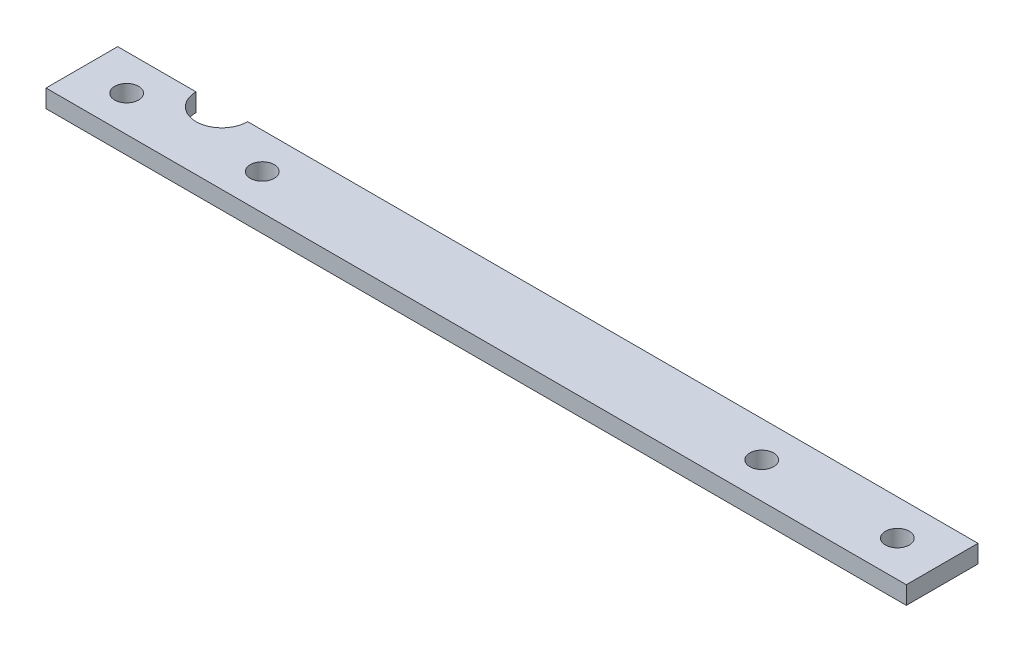
ISO-10303-21;
HEADER;
FILE_DESCRIPTION(('STEP AP214'),'2;1');
FILE_NAME('part.step','',(''),(''),'','','');
FILE_SCHEMA(('AUTOMOTIVE_DESIGN { 1 0 10303 214 1 1 1 1 }'));
ENDSEC;
DATA;
#1=APPLICATION_CONTEXT('core data for automotive mechanical design processes');
#2=APPLICATION_PROTOCOL_DEFINITION('international standard','automotive_design',2000,#1);
#3=PRODUCT_CONTEXT('',#1,'mechanical');
#4=PRODUCT('Part','Part','',(#3));
#5=PRODUCT_RELATED_PRODUCT_CATEGORY('part','',(#4));
#6=PRODUCT_DEFINITION_FORMATION('','',#4);
#7=PRODUCT_DEFINITION_CONTEXT('part definition',#1,'design');
#8=PRODUCT_DEFINITION('design','',#6,#7);
#9=PRODUCT_DEFINITION_SHAPE('','',#8);
#10=(LENGTH_UNIT() NAMED_UNIT(*) SI_UNIT(.MILLI.,.METRE.));
#11=(NAMED_UNIT(*) PLANE_ANGLE_UNIT() SI_UNIT($,.RADIAN.));
#12=(NAMED_UNIT(*) SI_UNIT($,.STERADIAN.) SOLID_ANGLE_UNIT());
#13=UNCERTAINTY_MEASURE_WITH_UNIT(LENGTH_MEASURE(1.E-05),#10,'distance_accuracy_value','');
#14=(GEOMETRIC_REPRESENTATION_CONTEXT(3) GLOBAL_UNCERTAINTY_ASSIGNED_CONTEXT((#13)) GLOBAL_UNIT_ASSIGNED_CONTEXT((#10,
#11,#12)) REPRESENTATION_CONTEXT('',''));
#15=CARTESIAN_POINT('',(0.,0.,0.));
#16=DIRECTION('',(0.,0.,1.));
#17=DIRECTION('',(1.,0.,0.));
#18=AXIS2_PLACEMENT_3D('',#15,#16,#17);
#19=CARTESIAN_POINT('',(-114.3,4.7625,-9.525));
#20=DIRECTION('',(0.,0.,-1.));
#21=DIRECTION('',(-1.,0.,0.));
#22=AXIS2_PLACEMENT_3D('',#19,#20,#21);
#23=PLANE('',#22);
#24=DIRECTION('',(0.,1.,0.));
#25=VECTOR('',#24,1.);
#26=CARTESIAN_POINT('',(-93.472,0.,-9.525));
#27=LINE('',#26,#25);
#28=CARTESIAN_POINT('',(-93.472,0.,-9.525));
#29=VERTEX_POINT('',#28);
#30=CARTESIAN_POINT('',(-93.472,4.7625,-9.525));
#31=VERTEX_POINT('',#30);
#32=EDGE_CURVE('E93',#29,#31,#27,.T.);
#33=ORIENTED_EDGE('',*,*,#32,.F.);
#34=DIRECTION('',(1.,0.,0.));
#35=VECTOR('',#34,1.);
#36=CARTESIAN_POINT('',(-114.3,0.,-9.525));
#37=LINE('',#36,#35);
#38=CARTESIAN_POINT('',(-114.3,0.,-9.525));
#39=VERTEX_POINT('',#38);
#40=EDGE_CURVE('E98',#39,#29,#37,.T.);
#41=ORIENTED_EDGE('',*,*,#40,.F.);
#42=DIRECTION('',(0.,-1.,0.));
#43=VECTOR('',#42,1.);
#44=CARTESIAN_POINT('',(-114.3,4.7625,-9.525));
#45=LINE('',#44,#43);
#46=CARTESIAN_POINT('',(-114.3,4.7625,-9.525));
#47=VERTEX_POINT('',#46);
#48=EDGE_CURVE('E56',#47,#39,#45,.T.);
#49=ORIENTED_EDGE('',*,*,#48,.F.);
#50=DIRECTION('',(1.,0.,0.));
#51=VECTOR('',#50,1.);
#52=CARTESIAN_POINT('',(-114.3,4.7625,-9.525));
#53=LINE('',#52,#51);
#54=EDGE_CURVE('E100',#47,#31,#53,.T.);
#55=ORIENTED_EDGE('',*,*,#54,.T.);
#56=EDGE_LOOP('',(#33,#41,#49,#55));
#57=FACE_BOUND('',#56,.T.);
#58=ADVANCED_FACE('F33',(#57),#23,.T.);
#59=CARTESIAN_POINT('',(-114.3,4.7625,-9.525));
#60=DIRECTION('',(1.,0.,0.));
#61=DIRECTION('',(0.,0.,-1.));
#62=AXIS2_PLACEMENT_3D('',#59,#60,#61);
#63=PLANE('',#62);
#64=DIRECTION('',(0.,0.,1.));
#65=VECTOR('',#64,1.);
#66=CARTESIAN_POINT('',(-114.3,0.,-9.525));
#67=LINE('',#66,#65);
#68=CARTESIAN_POINT('',(-114.3,0.,9.525));
#69=VERTEX_POINT('',#68);
#70=EDGE_CURVE('E104',#39,#69,#67,.T.);
#71=ORIENTED_EDGE('',*,*,#70,.T.);
#72=DIRECTION('',(0.,-1.,0.));
#73=VECTOR('',#72,1.);
#74=CARTESIAN_POINT('',(-114.3,4.7625,9.525));
#75=LINE('',#74,#73);
#76=CARTESIAN_POINT('',(-114.3,4.7625,9.525));
#77=VERTEX_POINT('',#76);
#78=EDGE_CURVE('E41',#77,#69,#75,.T.);
#79=ORIENTED_EDGE('',*,*,#78,.F.);
#80=DIRECTION('',(0.,0.,1.));
#81=VECTOR('',#80,1.);
#82=CARTESIAN_POINT('',(-114.3,4.7625,-9.525));
#83=LINE('',#82,#81);
#84=EDGE_CURVE('E105',#47,#77,#83,.T.);
#85=ORIENTED_EDGE('',*,*,#84,.F.);
#86=ORIENTED_EDGE('',*,*,#48,.T.);
#87=EDGE_LOOP('',(#71,#79,#85,#86));
#88=FACE_BOUND('',#87,.T.);
#89=ADVANCED_FACE('F35',(#88),#63,.F.);
#90=CARTESIAN_POINT('',(-114.3,4.7625,9.525));
#91=DIRECTION('',(0.,0.,-1.));
#92=DIRECTION('',(-1.,0.,0.));
#93=AXIS2_PLACEMENT_3D('',#90,#91,#92);
#94=PLANE('',#93);
#95=DIRECTION('',(1.,0.,0.));
#96=VECTOR('',#95,1.);
#97=CARTESIAN_POINT('',(-114.3,0.,9.525));
#98=LINE('',#97,#96);
#99=CARTESIAN_POINT('',(114.3,0.,9.525));
#100=VERTEX_POINT('',#99);
#101=EDGE_CURVE('E121',#69,#100,#98,.T.);
#102=ORIENTED_EDGE('',*,*,#101,.T.);
#103=DIRECTION('',(0.,-1.,0.));
#104=VECTOR('',#103,1.);
#105=CARTESIAN_POINT('',(114.3,4.7625,9.525));
#106=LINE('',#105,#104);
#107=CARTESIAN_POINT('',(114.3,4.7625,9.525));
#108=VERTEX_POINT('',#107);
#109=EDGE_CURVE('E117',#108,#100,#106,.T.);
#110=ORIENTED_EDGE('',*,*,#109,.F.);
#111=DIRECTION('',(1.,0.,0.));
#112=VECTOR('',#111,1.);
#113=CARTESIAN_POINT('',(-114.3,4.7625,9.525));
#114=LINE('',#113,#112);
#115=EDGE_CURVE('E83',#77,#108,#114,.T.);
#116=ORIENTED_EDGE('',*,*,#115,.F.);
#117=ORIENTED_EDGE('',*,*,#78,.T.);
#118=EDGE_LOOP('',(#102,#110,#116,#117));
#119=FACE_BOUND('',#118,.T.);
#120=ADVANCED_FACE('F120',(#119),#94,.F.);
#121=CARTESIAN_POINT('',(114.3,4.7625,-9.525));
#122=DIRECTION('',(1.,0.,0.));
#123=DIRECTION('',(0.,0.,-1.));
#124=AXIS2_PLACEMENT_3D('',#121,#122,#123);
#125=PLANE('',#124);
#126=DIRECTION('',(0.,0.,1.));
#127=VECTOR('',#126,1.);
#128=CARTESIAN_POINT('',(114.3,0.,-9.525));
#129=LINE('',#128,#127);
#130=CARTESIAN_POINT('',(114.3,0.,-9.525));
#131=VERTEX_POINT('',#130);
#132=EDGE_CURVE('E109',#131,#100,#129,.T.);
#133=ORIENTED_EDGE('',*,*,#132,.F.);
#134=DIRECTION('',(0.,-1.,0.));
#135=VECTOR('',#134,1.);
#136=CARTESIAN_POINT('',(114.3,4.7625,-9.525));
#137=LINE('',#136,#135);
#138=CARTESIAN_POINT('',(114.3,4.7625,-9.525));
#139=VERTEX_POINT('',#138);
#140=EDGE_CURVE('E114',#139,#131,#137,.T.);
#141=ORIENTED_EDGE('',*,*,#140,.F.);
#142=DIRECTION('',(0.,0.,1.));
#143=VECTOR('',#142,1.);
#144=CARTESIAN_POINT('',(114.3,4.7625,-9.525));
#145=LINE('',#144,#143);
#146=EDGE_CURVE('E131',#139,#108,#145,.T.);
#147=ORIENTED_EDGE('',*,*,#146,.T.);
#148=ORIENTED_EDGE('',*,*,#109,.T.);
#149=EDGE_LOOP('',(#133,#141,#147,#148));
#150=FACE_BOUND('',#149,.T.);
#151=ADVANCED_FACE('F202',(#150),#125,.T.);
#152=DIRECTION('',(0.,1.,0.));
#153=VECTOR('',#152,1.);
#154=CARTESIAN_POINT('',(-79.756,0.,-9.525));
#155=LINE('',#154,#153);
#156=CARTESIAN_POINT('',(-79.756,4.7625,-9.525));
#157=VERTEX_POINT('',#156);
#158=CARTESIAN_POINT('',(-79.756,0.,-9.525));
#159=VERTEX_POINT('',#158);
#160=EDGE_CURVE('E48',#157,#159,#155,.F.);
#161=ORIENTED_EDGE('',*,*,#160,.F.);
#162=EDGE_CURVE('E130',#157,#139,#53,.T.);
#163=ORIENTED_EDGE('',*,*,#162,.T.);
#164=ORIENTED_EDGE('',*,*,#140,.T.);
#165=EDGE_CURVE('E106',#159,#131,#37,.T.);
#166=ORIENTED_EDGE('',*,*,#165,.F.);
#167=EDGE_LOOP('',(#161,#163,#164,#166));
#168=FACE_BOUND('',#167,.T.);
#169=ADVANCED_FACE('F170',(#168),#23,.T.);
#170=CARTESIAN_POINT('',(0.,4.7625,0.));
#171=DIRECTION('',(0.,1.,0.));
#172=DIRECTION('',(0.,0.,1.));
#173=AXIS2_PLACEMENT_3D('',#170,#171,#172);
#174=PLANE('',#173);
#175=CARTESIAN_POINT('',(66.3575,4.7625,0.));
#176=DIRECTION('',(0.,1.,0.));
#177=DIRECTION('',(0.,0.,1.));
#178=AXIS2_PLACEMENT_3D('',#175,#176,#177);
#179=CIRCLE('',#178,3.175);
#180=CARTESIAN_POINT('',(66.3575,4.7625,3.175));
#181=VERTEX_POINT('',#180);
#182=EDGE_CURVE('E152',#181,#181,#179,.T.);
#183=ORIENTED_EDGE('',*,*,#182,.F.);
#184=EDGE_LOOP('',(#183));
#185=FACE_BOUND('',#184,.T.);
#186=CARTESIAN_POINT('',(-66.3575,4.7625,0.));
#187=DIRECTION('',(0.,1.,0.));
#188=DIRECTION('',(0.,0.,1.));
#189=AXIS2_PLACEMENT_3D('',#186,#187,#188);
#190=CIRCLE('',#189,3.175);
#191=CARTESIAN_POINT('',(-66.3575,4.7625,3.175));
#192=VERTEX_POINT('',#191);
#193=EDGE_CURVE('E146',#192,#192,#190,.T.);
#194=ORIENTED_EDGE('',*,*,#193,.F.);
#195=EDGE_LOOP('',(#194));
#196=FACE_BOUND('',#195,.T.);
#197=CARTESIAN_POINT('',(-86.614,4.7625,-9.525));
#198=DIRECTION('',(0.,1.,0.));
#199=DIRECTION('',(0.,0.,1.));
#200=AXIS2_PLACEMENT_3D('',#197,#198,#199);
#201=CIRCLE('',#200,6.858);
#202=EDGE_CURVE('E143',#31,#157,#201,.T.);
#203=ORIENTED_EDGE('',*,*,#202,.F.);
#204=ORIENTED_EDGE('',*,*,#54,.F.);
#205=ORIENTED_EDGE('',*,*,#84,.T.);
#206=ORIENTED_EDGE('',*,*,#115,.T.);
#207=ORIENTED_EDGE('',*,*,#146,.F.);
#208=ORIENTED_EDGE('',*,*,#162,.F.);
#209=EDGE_LOOP('',(#203,#204,#205,#206,#207,#208));
#210=FACE_BOUND('',#209,.T.);
#211=CARTESIAN_POINT('',(-102.39375,4.7625,0.));
#212=DIRECTION('',(0.,1.,0.));
#213=DIRECTION('',(0.,0.,-1.));
#214=AXIS2_PLACEMENT_3D('',#211,#212,#213);
#215=CIRCLE('',#214,3.175);
#216=CARTESIAN_POINT('',(-102.39375,4.7625,-3.175));
#217=VERTEX_POINT('',#216);
#218=EDGE_CURVE('E101',#217,#217,#215,.T.);
#219=ORIENTED_EDGE('',*,*,#218,.F.);
#220=EDGE_LOOP('',(#219));
#221=FACE_BOUND('',#220,.T.);
#222=CARTESIAN_POINT('',(102.39375,4.7625,0.));
#223=DIRECTION('',(0.,1.,0.));
#224=DIRECTION('',(0.,0.,1.));
#225=AXIS2_PLACEMENT_3D('',#222,#223,#224);
#226=CIRCLE('',#225,3.175);
#227=CARTESIAN_POINT('',(102.39375,4.7625,3.175));
#228=VERTEX_POINT('',#227);
#229=EDGE_CURVE('E126',#228,#228,#226,.T.);
#230=ORIENTED_EDGE('',*,*,#229,.F.);
#231=EDGE_LOOP('',(#230));
#232=FACE_BOUND('',#231,.T.);
#233=ADVANCED_FACE('F167',(#185,#196,#210,#221,#232),#174,.T.);
#234=CARTESIAN_POINT('',(0.,0.,0.));
#235=DIRECTION('',(0.,1.,0.));
#236=DIRECTION('',(0.,0.,1.));
#237=AXIS2_PLACEMENT_3D('',#234,#235,#236);
#238=PLANE('',#237);
#239=CARTESIAN_POINT('',(66.3575,0.,0.));
#240=DIRECTION('',(0.,1.,0.));
#241=DIRECTION('',(0.,0.,1.));
#242=AXIS2_PLACEMENT_3D('',#239,#240,#241);
#243=CIRCLE('',#242,3.175);
#244=CARTESIAN_POINT('',(66.3575,0.,3.175));
#245=VERTEX_POINT('',#244);
#246=EDGE_CURVE('E149',#245,#245,#243,.T.);
#247=ORIENTED_EDGE('',*,*,#246,.T.);
#248=EDGE_LOOP('',(#247));
#249=FACE_BOUND('',#248,.T.);
#250=CARTESIAN_POINT('',(-66.3575,0.,0.));
#251=DIRECTION('',(0.,1.,0.));
#252=DIRECTION('',(0.,0.,1.));
#253=AXIS2_PLACEMENT_3D('',#250,#251,#252);
#254=CIRCLE('',#253,3.175);
#255=CARTESIAN_POINT('',(-66.3575,0.,3.175));
#256=VERTEX_POINT('',#255);
#257=EDGE_CURVE('E145',#256,#256,#254,.T.);
#258=ORIENTED_EDGE('',*,*,#257,.T.);
#259=EDGE_LOOP('',(#258));
#260=FACE_BOUND('',#259,.T.);
#261=CARTESIAN_POINT('',(-102.39375,0.,0.));
#262=DIRECTION('',(0.,1.,0.));
#263=DIRECTION('',(0.,0.,-1.));
#264=AXIS2_PLACEMENT_3D('',#261,#262,#263);
#265=CIRCLE('',#264,3.175);
#266=CARTESIAN_POINT('',(-102.39375,0.,-3.175));
#267=VERTEX_POINT('',#266);
#268=EDGE_CURVE('E136',#267,#267,#265,.T.);
#269=ORIENTED_EDGE('',*,*,#268,.T.);
#270=EDGE_LOOP('',(#269));
#271=FACE_BOUND('',#270,.T.);
#272=CARTESIAN_POINT('',(102.39375,0.,0.));
#273=DIRECTION('',(0.,1.,0.));
#274=DIRECTION('',(0.,0.,1.));
#275=AXIS2_PLACEMENT_3D('',#272,#273,#274);
#276=CIRCLE('',#275,3.175);
#277=CARTESIAN_POINT('',(102.39375,0.,3.175));
#278=VERTEX_POINT('',#277);
#279=EDGE_CURVE('E123',#278,#278,#276,.T.);
#280=ORIENTED_EDGE('',*,*,#279,.T.);
#281=EDGE_LOOP('',(#280));
#282=FACE_BOUND('',#281,.T.);
#283=ORIENTED_EDGE('',*,*,#40,.T.);
#284=CARTESIAN_POINT('',(-86.614,0.,-9.525));
#285=DIRECTION('',(0.,1.,0.));
#286=DIRECTION('',(0.,0.,1.));
#287=AXIS2_PLACEMENT_3D('',#284,#285,#286);
#288=CIRCLE('',#287,6.858);
#289=EDGE_CURVE('E11',#29,#159,#288,.T.);
#290=ORIENTED_EDGE('',*,*,#289,.T.);
#291=ORIENTED_EDGE('',*,*,#165,.T.);
#292=ORIENTED_EDGE('',*,*,#132,.T.);
#293=ORIENTED_EDGE('',*,*,#101,.F.);
#294=ORIENTED_EDGE('',*,*,#70,.F.);
#295=EDGE_LOOP('',(#283,#290,#291,#292,#293,#294));
#296=FACE_BOUND('',#295,.T.);
#297=ADVANCED_FACE('F103',(#249,#260,#271,#282,#296),#238,.F.);
#298=CARTESIAN_POINT('',(102.39375,0.,0.));
#299=DIRECTION('',(0.,1.,0.));
#300=DIRECTION('',(0.,0.,1.));
#301=AXIS2_PLACEMENT_3D('',#298,#299,#300);
#302=CYLINDRICAL_SURFACE('',#301,3.175);
#303=ORIENTED_EDGE('',*,*,#279,.F.);
#304=EDGE_LOOP('',(#303));
#305=FACE_BOUND('',#304,.T.);
#306=ORIENTED_EDGE('',*,*,#229,.T.);
#307=EDGE_LOOP('',(#306));
#308=FACE_BOUND('',#307,.T.);
#309=ADVANCED_FACE('F180',(#305,#308),#302,.F.);
#310=CARTESIAN_POINT('',(-102.39375,0.,0.));
#311=DIRECTION('',(0.,1.,0.));
#312=DIRECTION('',(0.,0.,1.));
#313=AXIS2_PLACEMENT_3D('',#310,#311,#312);
#314=CYLINDRICAL_SURFACE('',#313,3.175);
#315=ORIENTED_EDGE('',*,*,#268,.F.);
#316=EDGE_LOOP('',(#315));
#317=FACE_BOUND('',#316,.T.);
#318=ORIENTED_EDGE('',*,*,#218,.T.);
#319=EDGE_LOOP('',(#318));
#320=FACE_BOUND('',#319,.T.);
#321=ADVANCED_FACE('F182',(#317,#320),#314,.F.);
#322=CARTESIAN_POINT('',(-86.614,0.,-9.525));
#323=DIRECTION('',(0.,1.,0.));
#324=DIRECTION('',(0.,0.,1.));
#325=AXIS2_PLACEMENT_3D('',#322,#323,#324);
#326=CYLINDRICAL_SURFACE('',#325,6.858);
#327=ORIENTED_EDGE('',*,*,#32,.T.);
#328=ORIENTED_EDGE('',*,*,#202,.T.);
#329=ORIENTED_EDGE('',*,*,#160,.T.);
#330=ORIENTED_EDGE('',*,*,#289,.F.);
#331=EDGE_LOOP('',(#327,#328,#329,#330));
#332=FACE_BOUND('',#331,.T.);
#333=ADVANCED_FACE('F92',(#332),#326,.F.);
#334=CARTESIAN_POINT('',(-66.3575,0.,0.));
#335=DIRECTION('',(0.,1.,0.));
#336=DIRECTION('',(0.,0.,1.));
#337=AXIS2_PLACEMENT_3D('',#334,#335,#336);
#338=CYLINDRICAL_SURFACE('',#337,3.175);
#339=ORIENTED_EDGE('',*,*,#257,.F.);
#340=EDGE_LOOP('',(#339));
#341=FACE_BOUND('',#340,.T.);
#342=ORIENTED_EDGE('',*,*,#193,.T.);
#343=EDGE_LOOP('',(#342));
#344=FACE_BOUND('',#343,.T.);
#345=ADVANCED_FACE('F163',(#341,#344),#338,.F.);
#346=CARTESIAN_POINT('',(66.3575,0.,0.));
#347=DIRECTION('',(0.,1.,0.));
#348=DIRECTION('',(0.,0.,1.));
#349=AXIS2_PLACEMENT_3D('',#346,#347,#348);
#350=CYLINDRICAL_SURFACE('',#349,3.175);
#351=ORIENTED_EDGE('',*,*,#246,.F.);
#352=EDGE_LOOP('',(#351));
#353=FACE_BOUND('',#352,.T.);
#354=ORIENTED_EDGE('',*,*,#182,.T.);
#355=EDGE_LOOP('',(#354));
#356=FACE_BOUND('',#355,.T.);
#357=ADVANCED_FACE('F160',(#353,#356),#350,.F.);
#358=CLOSED_SHELL('',(#58,#89,#120,#151,#169,#233,#297,#309,#321,#333,#345,#357));
#359=MANIFOLD_SOLID_BREP('B2',#358);
#360=ADVANCED_BREP_SHAPE_REPRESENTATION('',(#18,#359),#14);
#361=SHAPE_DEFINITION_REPRESENTATION(#9,#360);
ENDSEC;
END-ISO-10303-21;
